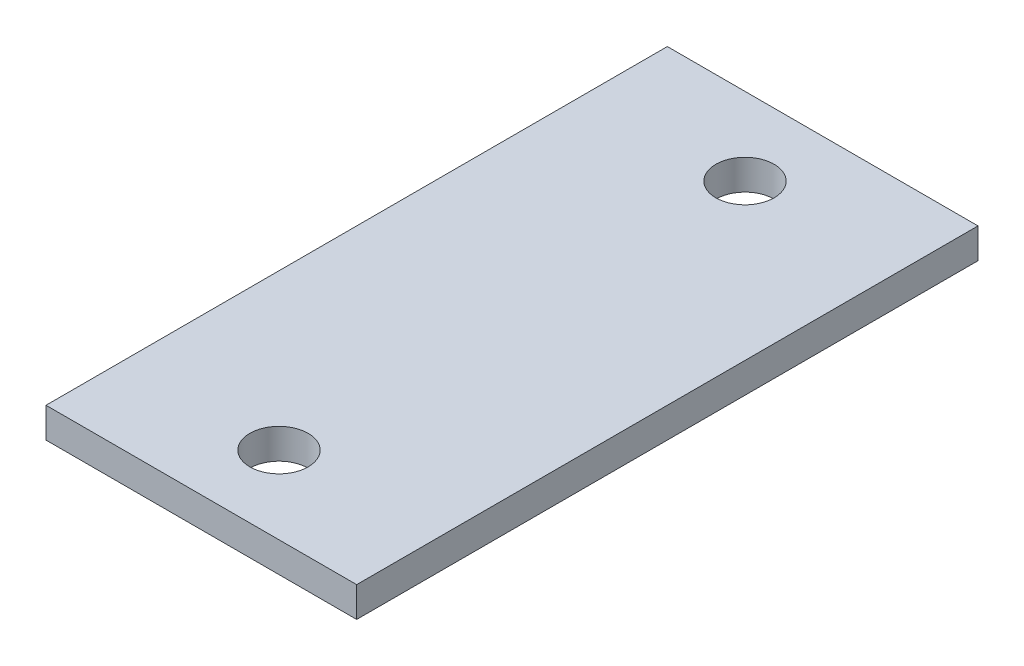
ISO-10303-21;
HEADER;
FILE_DESCRIPTION(('STEP AP214'),'2;1');
FILE_NAME('part.step','',(''),(''),'','','');
FILE_SCHEMA(('AUTOMOTIVE_DESIGN { 1 0 10303 214 1 1 1 1 }'));
ENDSEC;
DATA;
#1=APPLICATION_CONTEXT('core data for automotive mechanical design processes');
#2=APPLICATION_PROTOCOL_DEFINITION('international standard','automotive_design',2000,#1);
#3=PRODUCT_CONTEXT('',#1,'mechanical');
#4=PRODUCT('Part','Part','',(#3));
#5=PRODUCT_RELATED_PRODUCT_CATEGORY('part','',(#4));
#6=PRODUCT_DEFINITION_FORMATION('','',#4);
#7=PRODUCT_DEFINITION_CONTEXT('part definition',#1,'design');
#8=PRODUCT_DEFINITION('design','',#6,#7);
#9=PRODUCT_DEFINITION_SHAPE('','',#8);
#10=(LENGTH_UNIT() NAMED_UNIT(*) SI_UNIT(.MILLI.,.METRE.));
#11=(NAMED_UNIT(*) PLANE_ANGLE_UNIT() SI_UNIT($,.RADIAN.));
#12=(NAMED_UNIT(*) SI_UNIT($,.STERADIAN.) SOLID_ANGLE_UNIT());
#13=UNCERTAINTY_MEASURE_WITH_UNIT(LENGTH_MEASURE(1.E-05),#10,'distance_accuracy_value','');
#14=(GEOMETRIC_REPRESENTATION_CONTEXT(3) GLOBAL_UNCERTAINTY_ASSIGNED_CONTEXT((#13)) GLOBAL_UNIT_ASSIGNED_CONTEXT((#10,
#11,#12)) REPRESENTATION_CONTEXT('',''));
#15=CARTESIAN_POINT('',(0.,0.,0.));
#16=DIRECTION('',(0.,0.,1.));
#17=DIRECTION('',(1.,0.,0.));
#18=AXIS2_PLACEMENT_3D('',#15,#16,#17);
#19=CARTESIAN_POINT('',(0.,4.93522,0.));
#20=DIRECTION('',(0.,-1.,0.));
#21=DIRECTION('',(0.,0.,-1.));
#22=AXIS2_PLACEMENT_3D('',#19,#20,#21);
#23=PLANE('',#22);
#24=DIRECTION('',(0.,0.,1.));
#25=VECTOR('',#24,1.);
#26=CARTESIAN_POINT('',(0.,4.93522,0.));
#27=LINE('',#26,#25);
#28=CARTESIAN_POINT('',(0.,4.93522,-101.6));
#29=VERTEX_POINT('',#28);
#30=CARTESIAN_POINT('',(0.,4.93522,0.));
#31=VERTEX_POINT('',#30);
#32=EDGE_CURVE('E89',#29,#31,#27,.T.);
#33=ORIENTED_EDGE('',*,*,#32,.T.);
#34=DIRECTION('',(1.,0.,0.));
#35=VECTOR('',#34,1.);
#36=CARTESIAN_POINT('',(0.,4.93522,0.));
#37=LINE('',#36,#35);
#38=CARTESIAN_POINT('',(50.8,4.93522,0.));
#39=VERTEX_POINT('',#38);
#40=EDGE_CURVE('E84',#31,#39,#37,.T.);
#41=ORIENTED_EDGE('',*,*,#40,.T.);
#42=DIRECTION('',(0.,0.,-1.));
#43=VECTOR('',#42,1.);
#44=CARTESIAN_POINT('',(50.8,4.93522,0.));
#45=LINE('',#44,#43);
#46=CARTESIAN_POINT('',(50.8,4.93522,-101.6));
#47=VERTEX_POINT('',#46);
#48=EDGE_CURVE('E87',#39,#47,#45,.T.);
#49=ORIENTED_EDGE('',*,*,#48,.T.);
#50=DIRECTION('',(-1.,0.,0.));
#51=VECTOR('',#50,1.);
#52=CARTESIAN_POINT('',(0.,4.93522,-101.6));
#53=LINE('',#52,#51);
#54=EDGE_CURVE('E54',#47,#29,#53,.T.);
#55=ORIENTED_EDGE('',*,*,#54,.T.);
#56=EDGE_LOOP('',(#33,#41,#49,#55));
#57=FACE_BOUND('',#56,.T.);
#58=CARTESIAN_POINT('',(25.4,4.93522,-12.7));
#59=DIRECTION('',(0.,1.,0.));
#60=DIRECTION('',(0.,0.,1.));
#61=AXIS2_PLACEMENT_3D('',#58,#59,#60);
#62=CIRCLE('',#61,4.7625);
#63=CARTESIAN_POINT('',(25.4,4.93522,-7.9375));
#64=VERTEX_POINT('',#63);
#65=EDGE_CURVE('E104',#64,#64,#62,.T.);
#66=ORIENTED_EDGE('',*,*,#65,.F.);
#67=EDGE_LOOP('',(#66));
#68=FACE_BOUND('',#67,.T.);
#69=CARTESIAN_POINT('',(25.4,4.93522,-88.9));
#70=DIRECTION('',(0.,1.,0.));
#71=DIRECTION('',(0.,0.,1.));
#72=AXIS2_PLACEMENT_3D('',#69,#70,#71);
#73=CIRCLE('',#72,4.7625);
#74=CARTESIAN_POINT('',(25.4,4.93522,-84.1375));
#75=VERTEX_POINT('',#74);
#76=EDGE_CURVE('E119',#75,#75,#73,.T.);
#77=ORIENTED_EDGE('',*,*,#76,.F.);
#78=EDGE_LOOP('',(#77));
#79=FACE_BOUND('',#78,.T.);
#80=ADVANCED_FACE('F37',(#57,#68,#79),#23,.F.);
#81=CARTESIAN_POINT('',(0.,0.,0.));
#82=DIRECTION('',(0.,-1.,0.));
#83=DIRECTION('',(0.,0.,-1.));
#84=AXIS2_PLACEMENT_3D('',#81,#82,#83);
#85=PLANE('',#84);
#86=CARTESIAN_POINT('',(25.4,0.,-12.7));
#87=DIRECTION('',(0.,1.,0.));
#88=DIRECTION('',(0.,0.,1.));
#89=AXIS2_PLACEMENT_3D('',#86,#87,#88);
#90=CIRCLE('',#89,4.7625);
#91=CARTESIAN_POINT('',(25.4,0.,-7.9375));
#92=VERTEX_POINT('',#91);
#93=EDGE_CURVE('E116',#92,#92,#90,.T.);
#94=ORIENTED_EDGE('',*,*,#93,.T.);
#95=EDGE_LOOP('',(#94));
#96=FACE_BOUND('',#95,.T.);
#97=DIRECTION('',(0.,0.,1.));
#98=VECTOR('',#97,1.);
#99=CARTESIAN_POINT('',(0.,0.,0.));
#100=LINE('',#99,#98);
#101=CARTESIAN_POINT('',(0.,0.,-101.6));
#102=VERTEX_POINT('',#101);
#103=CARTESIAN_POINT('',(0.,0.,0.));
#104=VERTEX_POINT('',#103);
#105=EDGE_CURVE('E101',#102,#104,#100,.T.);
#106=ORIENTED_EDGE('',*,*,#105,.F.);
#107=DIRECTION('',(-1.,0.,0.));
#108=VECTOR('',#107,1.);
#109=CARTESIAN_POINT('',(0.,0.,-101.6));
#110=LINE('',#109,#108);
#111=CARTESIAN_POINT('',(50.8,0.,-101.6));
#112=VERTEX_POINT('',#111);
#113=EDGE_CURVE('E77',#112,#102,#110,.T.);
#114=ORIENTED_EDGE('',*,*,#113,.F.);
#115=DIRECTION('',(0.,0.,-1.));
#116=VECTOR('',#115,1.);
#117=CARTESIAN_POINT('',(50.8,0.,0.));
#118=LINE('',#117,#116);
#119=CARTESIAN_POINT('',(50.8,0.,0.));
#120=VERTEX_POINT('',#119);
#121=EDGE_CURVE('E71',#120,#112,#118,.T.);
#122=ORIENTED_EDGE('',*,*,#121,.F.);
#123=DIRECTION('',(1.,0.,0.));
#124=VECTOR('',#123,1.);
#125=CARTESIAN_POINT('',(0.,0.,0.));
#126=LINE('',#125,#124);
#127=EDGE_CURVE('E93',#104,#120,#126,.T.);
#128=ORIENTED_EDGE('',*,*,#127,.F.);
#129=EDGE_LOOP('',(#106,#114,#122,#128));
#130=FACE_BOUND('',#129,.T.);
#131=CARTESIAN_POINT('',(25.4,0.,-88.9));
#132=DIRECTION('',(0.,1.,0.));
#133=DIRECTION('',(0.,0.,1.));
#134=AXIS2_PLACEMENT_3D('',#131,#132,#133);
#135=CIRCLE('',#134,4.7625);
#136=CARTESIAN_POINT('',(25.4,0.,-84.1375));
#137=VERTEX_POINT('',#136);
#138=EDGE_CURVE('E122',#137,#137,#135,.T.);
#139=ORIENTED_EDGE('',*,*,#138,.T.);
#140=EDGE_LOOP('',(#139));
#141=FACE_BOUND('',#140,.T.);
#142=ADVANCED_FACE('F112',(#96,#130,#141),#85,.T.);
#143=CARTESIAN_POINT('',(0.,4.93522,0.));
#144=DIRECTION('',(1.,0.,0.));
#145=DIRECTION('',(0.,0.,-1.));
#146=AXIS2_PLACEMENT_3D('',#143,#144,#145);
#147=PLANE('',#146);
#148=ORIENTED_EDGE('',*,*,#105,.T.);
#149=DIRECTION('',(0.,-1.,0.));
#150=VECTOR('',#149,1.);
#151=CARTESIAN_POINT('',(0.,4.93522,0.));
#152=LINE('',#151,#150);
#153=EDGE_CURVE('E11',#31,#104,#152,.T.);
#154=ORIENTED_EDGE('',*,*,#153,.F.);
#155=ORIENTED_EDGE('',*,*,#32,.F.);
#156=DIRECTION('',(0.,-1.,0.));
#157=VECTOR('',#156,1.);
#158=CARTESIAN_POINT('',(0.,4.93522,-101.6));
#159=LINE('',#158,#157);
#160=EDGE_CURVE('E97',#29,#102,#159,.T.);
#161=ORIENTED_EDGE('',*,*,#160,.T.);
#162=EDGE_LOOP('',(#148,#154,#155,#161));
#163=FACE_BOUND('',#162,.T.);
#164=ADVANCED_FACE('F39',(#163),#147,.F.);
#165=CARTESIAN_POINT('',(0.,4.93522,0.));
#166=DIRECTION('',(0.,0.,-1.));
#167=DIRECTION('',(-1.,0.,0.));
#168=AXIS2_PLACEMENT_3D('',#165,#166,#167);
#169=PLANE('',#168);
#170=ORIENTED_EDGE('',*,*,#127,.T.);
#171=DIRECTION('',(0.,-1.,0.));
#172=VECTOR('',#171,1.);
#173=CARTESIAN_POINT('',(50.8,4.93522,0.));
#174=LINE('',#173,#172);
#175=EDGE_CURVE('E46',#39,#120,#174,.T.);
#176=ORIENTED_EDGE('',*,*,#175,.F.);
#177=ORIENTED_EDGE('',*,*,#40,.F.);
#178=ORIENTED_EDGE('',*,*,#153,.T.);
#179=EDGE_LOOP('',(#170,#176,#177,#178));
#180=FACE_BOUND('',#179,.T.);
#181=ADVANCED_FACE('F92',(#180),#169,.F.);
#182=CARTESIAN_POINT('',(50.8,4.93522,0.));
#183=DIRECTION('',(-1.,0.,0.));
#184=DIRECTION('',(0.,0.,1.));
#185=AXIS2_PLACEMENT_3D('',#182,#183,#184);
#186=PLANE('',#185);
#187=ORIENTED_EDGE('',*,*,#121,.T.);
#188=DIRECTION('',(0.,-1.,0.));
#189=VECTOR('',#188,1.);
#190=CARTESIAN_POINT('',(50.8,4.93522,-101.6));
#191=LINE('',#190,#189);
#192=EDGE_CURVE('E94',#47,#112,#191,.T.);
#193=ORIENTED_EDGE('',*,*,#192,.F.);
#194=ORIENTED_EDGE('',*,*,#48,.F.);
#195=ORIENTED_EDGE('',*,*,#175,.T.);
#196=EDGE_LOOP('',(#187,#193,#194,#195));
#197=FACE_BOUND('',#196,.T.);
#198=ADVANCED_FACE('F95',(#197),#186,.F.);
#199=CARTESIAN_POINT('',(0.,4.93522,-101.6));
#200=DIRECTION('',(0.,0.,1.));
#201=DIRECTION('',(1.,0.,0.));
#202=AXIS2_PLACEMENT_3D('',#199,#200,#201);
#203=PLANE('',#202);
#204=ORIENTED_EDGE('',*,*,#113,.T.);
#205=ORIENTED_EDGE('',*,*,#160,.F.);
#206=ORIENTED_EDGE('',*,*,#54,.F.);
#207=ORIENTED_EDGE('',*,*,#192,.T.);
#208=EDGE_LOOP('',(#204,#205,#206,#207));
#209=FACE_BOUND('',#208,.T.);
#210=ADVANCED_FACE('F109',(#209),#203,.F.);
#211=CARTESIAN_POINT('',(25.4,4.93522,-12.7));
#212=DIRECTION('',(0.,-1.,0.));
#213=DIRECTION('',(0.,0.,-1.));
#214=AXIS2_PLACEMENT_3D('',#211,#212,#213);
#215=CYLINDRICAL_SURFACE('',#214,4.7625);
#216=ORIENTED_EDGE('',*,*,#65,.T.);
#217=EDGE_LOOP('',(#216));
#218=FACE_BOUND('',#217,.T.);
#219=ORIENTED_EDGE('',*,*,#93,.F.);
#220=EDGE_LOOP('',(#219));
#221=FACE_BOUND('',#220,.T.);
#222=ADVANCED_FACE('F139',(#218,#221),#215,.F.);
#223=CARTESIAN_POINT('',(25.4,4.93522,-88.9));
#224=DIRECTION('',(0.,-1.,0.));
#225=DIRECTION('',(0.,0.,-1.));
#226=AXIS2_PLACEMENT_3D('',#223,#224,#225);
#227=CYLINDRICAL_SURFACE('',#226,4.7625);
#228=ORIENTED_EDGE('',*,*,#76,.T.);
#229=EDGE_LOOP('',(#228));
#230=FACE_BOUND('',#229,.T.);
#231=ORIENTED_EDGE('',*,*,#138,.F.);
#232=EDGE_LOOP('',(#231));
#233=FACE_BOUND('',#232,.T.);
#234=ADVANCED_FACE('F128',(#230,#233),#227,.F.);
#235=CLOSED_SHELL('',(#80,#142,#164,#181,#198,#210,#222,#234));
#236=MANIFOLD_SOLID_BREP('B2',#235);
#237=ADVANCED_BREP_SHAPE_REPRESENTATION('',(#18,#236),#14);
#238=SHAPE_DEFINITION_REPRESENTATION(#9,#237);
ENDSEC;
END-ISO-10303-21;
